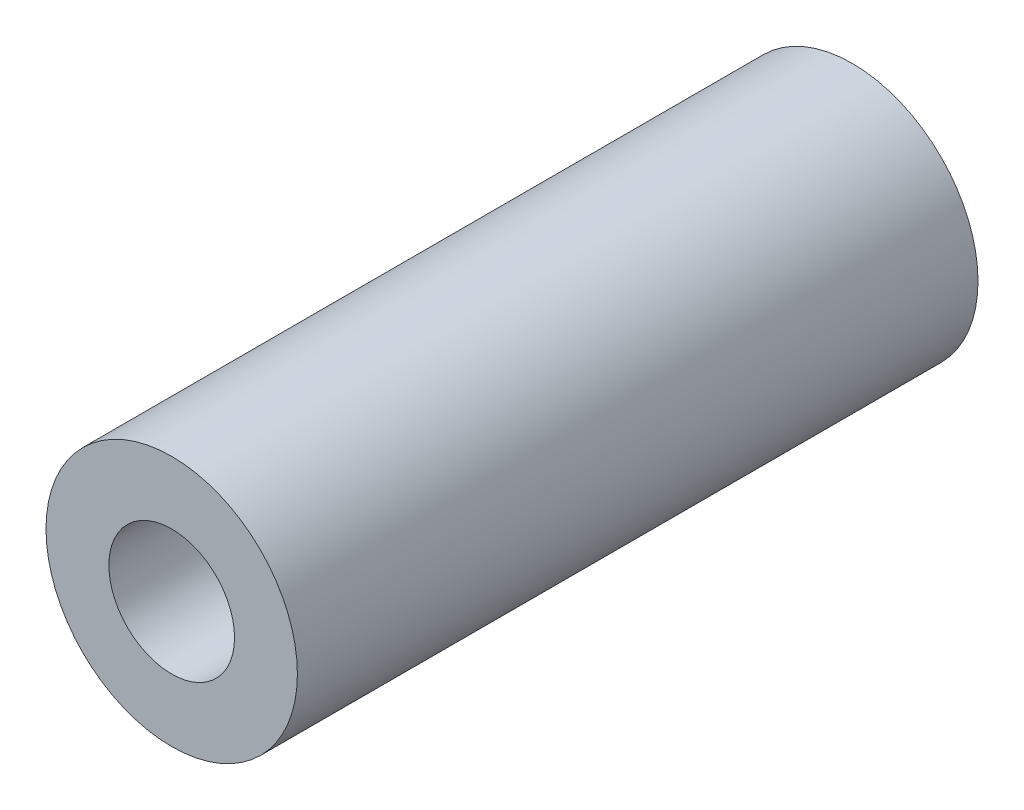
ISO-10303-21;
HEADER;
FILE_DESCRIPTION(('STEP AP214'),'2;1');
FILE_NAME('part.step','',(''),(''),'','','');
FILE_SCHEMA(('AUTOMOTIVE_DESIGN { 1 0 10303 214 1 1 1 1 }'));
ENDSEC;
DATA;
#1=APPLICATION_CONTEXT('core data for automotive mechanical design processes');
#2=APPLICATION_PROTOCOL_DEFINITION('international standard','automotive_design',2000,#1);
#3=PRODUCT_CONTEXT('',#1,'mechanical');
#4=PRODUCT('Part','Part','',(#3));
#5=PRODUCT_RELATED_PRODUCT_CATEGORY('part','',(#4));
#6=PRODUCT_DEFINITION_FORMATION('','',#4);
#7=PRODUCT_DEFINITION_CONTEXT('part definition',#1,'design');
#8=PRODUCT_DEFINITION('design','',#6,#7);
#9=PRODUCT_DEFINITION_SHAPE('','',#8);
#10=(LENGTH_UNIT() NAMED_UNIT(*) SI_UNIT(.MILLI.,.METRE.));
#11=(NAMED_UNIT(*) PLANE_ANGLE_UNIT() SI_UNIT($,.RADIAN.));
#12=(NAMED_UNIT(*) SI_UNIT($,.STERADIAN.) SOLID_ANGLE_UNIT());
#13=UNCERTAINTY_MEASURE_WITH_UNIT(LENGTH_MEASURE(1.E-05),#10,'distance_accuracy_value','');
#14=(GEOMETRIC_REPRESENTATION_CONTEXT(3) GLOBAL_UNCERTAINTY_ASSIGNED_CONTEXT((#13)) GLOBAL_UNIT_ASSIGNED_CONTEXT((#10,
#11,#12)) REPRESENTATION_CONTEXT('',''));
#15=CARTESIAN_POINT('',(0.,0.,0.));
#16=DIRECTION('',(0.,0.,1.));
#17=DIRECTION('',(1.,0.,0.));
#18=AXIS2_PLACEMENT_3D('',#15,#16,#17);
#19=CARTESIAN_POINT('',(0.,0.,34.383424502));
#20=DIRECTION('',(0.,0.,1.));
#21=DIRECTION('',(1.,0.,0.));
#22=AXIS2_PLACEMENT_3D('',#19,#20,#21);
#23=PLANE('',#22);
#24=CARTESIAN_POINT('',(0.,0.,34.383424502));
#25=DIRECTION('',(0.,0.,1.));
#26=DIRECTION('',(1.,0.,0.));
#27=AXIS2_PLACEMENT_3D('',#24,#25,#26);
#28=CIRCLE('',#27,6.35);
#29=CARTESIAN_POINT('',(6.35,0.,34.383424502));
#30=VERTEX_POINT('',#29);
#31=EDGE_CURVE('E10',#30,#30,#28,.T.);
#32=ORIENTED_EDGE('',*,*,#31,.T.);
#33=EDGE_LOOP('',(#32));
#34=FACE_BOUND('',#33,.T.);
#35=CARTESIAN_POINT('',(0.,0.,34.383424502));
#36=DIRECTION('',(0.,0.,1.));
#37=DIRECTION('',(1.,0.,0.));
#38=AXIS2_PLACEMENT_3D('',#35,#36,#37);
#39=CIRCLE('',#38,3.175);
#40=CARTESIAN_POINT('',(3.175,0.,34.383424502));
#41=VERTEX_POINT('',#40);
#42=EDGE_CURVE('E41',#41,#41,#39,.T.);
#43=ORIENTED_EDGE('',*,*,#42,.F.);
#44=EDGE_LOOP('',(#43));
#45=FACE_BOUND('',#44,.T.);
#46=ADVANCED_FACE('F30',(#34,#45),#23,.T.);
#47=CARTESIAN_POINT('',(0.,0.,0.));
#48=DIRECTION('',(0.,0.,1.));
#49=DIRECTION('',(1.,0.,0.));
#50=AXIS2_PLACEMENT_3D('',#47,#48,#49);
#51=PLANE('',#50);
#52=CARTESIAN_POINT('',(0.,0.,0.));
#53=DIRECTION('',(0.,0.,1.));
#54=DIRECTION('',(1.,0.,0.));
#55=AXIS2_PLACEMENT_3D('',#52,#53,#54);
#56=CIRCLE('',#55,6.35);
#57=CARTESIAN_POINT('',(6.35,0.,0.));
#58=VERTEX_POINT('',#57);
#59=EDGE_CURVE('E34',#58,#58,#56,.T.);
#60=ORIENTED_EDGE('',*,*,#59,.F.);
#61=EDGE_LOOP('',(#60));
#62=FACE_BOUND('',#61,.T.);
#63=CARTESIAN_POINT('',(0.,0.,0.));
#64=DIRECTION('',(0.,0.,1.));
#65=DIRECTION('',(1.,0.,0.));
#66=AXIS2_PLACEMENT_3D('',#63,#64,#65);
#67=CIRCLE('',#66,3.175);
#68=CARTESIAN_POINT('',(3.175,0.,0.));
#69=VERTEX_POINT('',#68);
#70=EDGE_CURVE('E43',#69,#69,#67,.T.);
#71=ORIENTED_EDGE('',*,*,#70,.T.);
#72=EDGE_LOOP('',(#71));
#73=FACE_BOUND('',#72,.T.);
#74=ADVANCED_FACE('F53',(#62,#73),#51,.F.);
#75=CARTESIAN_POINT('',(0.,0.,34.383424502));
#76=DIRECTION('',(0.,0.,-1.));
#77=DIRECTION('',(-1.,0.,0.));
#78=AXIS2_PLACEMENT_3D('',#75,#76,#77);
#79=CYLINDRICAL_SURFACE('',#78,6.35);
#80=ORIENTED_EDGE('',*,*,#31,.F.);
#81=EDGE_LOOP('',(#80));
#82=FACE_BOUND('',#81,.T.);
#83=ORIENTED_EDGE('',*,*,#59,.T.);
#84=EDGE_LOOP('',(#83));
#85=FACE_BOUND('',#84,.T.);
#86=ADVANCED_FACE('F32',(#82,#85),#79,.T.);
#87=CARTESIAN_POINT('',(0.,0.,34.383424502));
#88=DIRECTION('',(0.,0.,-1.));
#89=DIRECTION('',(-1.,0.,0.));
#90=AXIS2_PLACEMENT_3D('',#87,#88,#89);
#91=CYLINDRICAL_SURFACE('',#90,3.175);
#92=ORIENTED_EDGE('',*,*,#42,.T.);
#93=EDGE_LOOP('',(#92));
#94=FACE_BOUND('',#93,.T.);
#95=ORIENTED_EDGE('',*,*,#70,.F.);
#96=EDGE_LOOP('',(#95));
#97=FACE_BOUND('',#96,.T.);
#98=ADVANCED_FACE('F49',(#94,#97),#91,.F.);
#99=CLOSED_SHELL('',(#46,#74,#86,#98));
#100=MANIFOLD_SOLID_BREP('B2',#99);
#101=ADVANCED_BREP_SHAPE_REPRESENTATION('',(#18,#100),#14);
#102=SHAPE_DEFINITION_REPRESENTATION(#9,#101);
ENDSEC;
END-ISO-10303-21;
